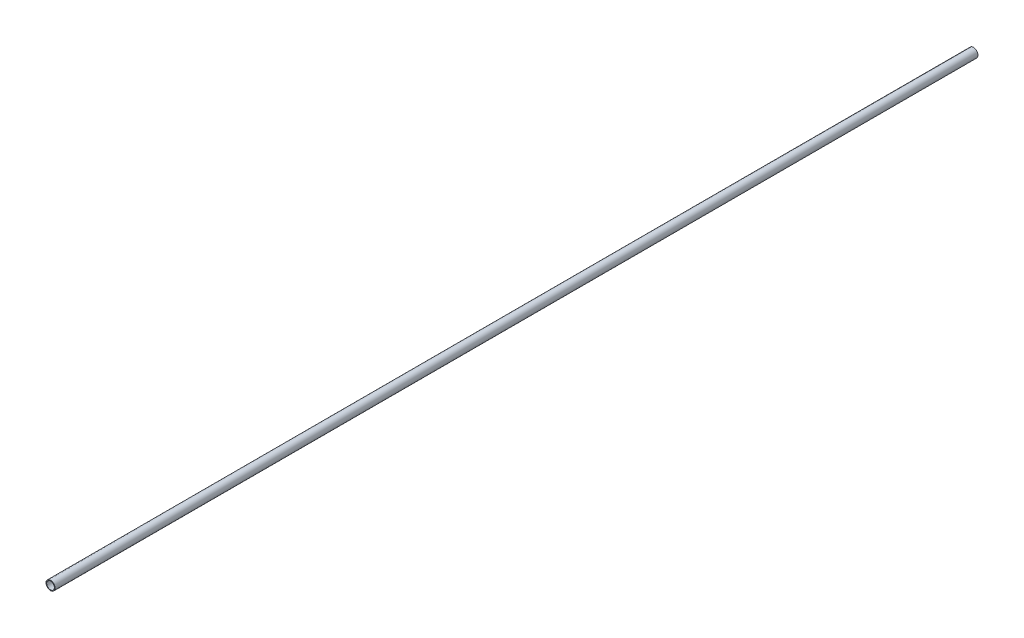
ISO-10303-21;
HEADER;
FILE_DESCRIPTION(('STEP AP214'),'2;1');
FILE_NAME('part.step','',(''),(''),'','','');
FILE_SCHEMA(('AUTOMOTIVE_DESIGN { 1 0 10303 214 1 1 1 1 }'));
ENDSEC;
DATA;
#1=APPLICATION_CONTEXT('core data for automotive mechanical design processes');
#2=APPLICATION_PROTOCOL_DEFINITION('international standard','automotive_design',2000,#1);
#3=PRODUCT_CONTEXT('',#1,'mechanical');
#4=PRODUCT('Part','Part','',(#3));
#5=PRODUCT_RELATED_PRODUCT_CATEGORY('part','',(#4));
#6=PRODUCT_DEFINITION_FORMATION('','',#4);
#7=PRODUCT_DEFINITION_CONTEXT('part definition',#1,'design');
#8=PRODUCT_DEFINITION('design','',#6,#7);
#9=PRODUCT_DEFINITION_SHAPE('','',#8);
#10=(LENGTH_UNIT() NAMED_UNIT(*) SI_UNIT(.MILLI.,.METRE.));
#11=(NAMED_UNIT(*) PLANE_ANGLE_UNIT() SI_UNIT($,.RADIAN.));
#12=(NAMED_UNIT(*) SI_UNIT($,.STERADIAN.) SOLID_ANGLE_UNIT());
#13=UNCERTAINTY_MEASURE_WITH_UNIT(LENGTH_MEASURE(1.E-05),#10,'distance_accuracy_value','');
#14=(GEOMETRIC_REPRESENTATION_CONTEXT(3) GLOBAL_UNCERTAINTY_ASSIGNED_CONTEXT((#13)) GLOBAL_UNIT_ASSIGNED_CONTEXT((#10,
#11,#12)) REPRESENTATION_CONTEXT('',''));
#15=CARTESIAN_POINT('',(0.,0.,0.));
#16=DIRECTION('',(0.,0.,1.));
#17=DIRECTION('',(1.,0.,0.));
#18=AXIS2_PLACEMENT_3D('',#15,#16,#17);
#19=CARTESIAN_POINT('',(0.,0.,1020.));
#20=DIRECTION('',(0.,0.,1.));
#21=DIRECTION('',(1.,0.,0.));
#22=AXIS2_PLACEMENT_3D('',#19,#20,#21);
#23=PLANE('',#22);
#24=CARTESIAN_POINT('',(0.,0.,1020.));
#25=DIRECTION('',(0.,0.,1.));
#26=DIRECTION('',(1.,0.,0.));
#27=AXIS2_PLACEMENT_3D('',#24,#25,#26);
#28=CIRCLE('',#27,5.);
#29=CARTESIAN_POINT('',(5.,0.,1020.));
#30=VERTEX_POINT('',#29);
#31=EDGE_CURVE('E10',#30,#30,#28,.T.);
#32=ORIENTED_EDGE('',*,*,#31,.T.);
#33=EDGE_LOOP('',(#32));
#34=FACE_BOUND('',#33,.T.);
#35=CARTESIAN_POINT('',(0.,0.,1020.));
#36=DIRECTION('',(0.,0.,1.));
#37=DIRECTION('',(1.,0.,0.));
#38=AXIS2_PLACEMENT_3D('',#35,#36,#37);
#39=CIRCLE('',#38,4.25);
#40=CARTESIAN_POINT('',(4.25,0.,1020.));
#41=VERTEX_POINT('',#40);
#42=EDGE_CURVE('E50',#41,#41,#39,.T.);
#43=ORIENTED_EDGE('',*,*,#42,.F.);
#44=EDGE_LOOP('',(#43));
#45=FACE_BOUND('',#44,.T.);
#46=ADVANCED_FACE('F37',(#34,#45),#23,.T.);
#47=CARTESIAN_POINT('',(0.,0.,0.));
#48=DIRECTION('',(0.,0.,1.));
#49=DIRECTION('',(1.,0.,0.));
#50=AXIS2_PLACEMENT_3D('',#47,#48,#49);
#51=PLANE('',#50);
#52=CARTESIAN_POINT('',(0.,0.,0.));
#53=DIRECTION('',(0.,0.,1.));
#54=DIRECTION('',(1.,0.,0.));
#55=AXIS2_PLACEMENT_3D('',#52,#53,#54);
#56=CIRCLE('',#55,5.);
#57=CARTESIAN_POINT('',(5.,0.,0.));
#58=VERTEX_POINT('',#57);
#59=EDGE_CURVE('E41',#58,#58,#56,.T.);
#60=ORIENTED_EDGE('',*,*,#59,.F.);
#61=EDGE_LOOP('',(#60));
#62=FACE_BOUND('',#61,.T.);
#63=CARTESIAN_POINT('',(0.,0.,0.));
#64=DIRECTION('',(0.,0.,1.));
#65=DIRECTION('',(1.,0.,0.));
#66=AXIS2_PLACEMENT_3D('',#63,#64,#65);
#67=CIRCLE('',#66,4.25);
#68=CARTESIAN_POINT('',(4.25,0.,0.));
#69=VERTEX_POINT('',#68);
#70=EDGE_CURVE('E52',#69,#69,#67,.T.);
#71=ORIENTED_EDGE('',*,*,#70,.T.);
#72=EDGE_LOOP('',(#71));
#73=FACE_BOUND('',#72,.T.);
#74=ADVANCED_FACE('F64',(#62,#73),#51,.F.);
#75=CARTESIAN_POINT('',(0.,0.,1020.));
#76=DIRECTION('',(0.,0.,-1.));
#77=DIRECTION('',(-1.,0.,0.));
#78=AXIS2_PLACEMENT_3D('',#75,#76,#77);
#79=CYLINDRICAL_SURFACE('',#78,5.);
#80=ORIENTED_EDGE('',*,*,#31,.F.);
#81=EDGE_LOOP('',(#80));
#82=FACE_BOUND('',#81,.T.);
#83=ORIENTED_EDGE('',*,*,#59,.T.);
#84=EDGE_LOOP('',(#83));
#85=FACE_BOUND('',#84,.T.);
#86=ADVANCED_FACE('F39',(#82,#85),#79,.T.);
#87=CARTESIAN_POINT('',(0.,0.,1020.));
#88=DIRECTION('',(0.,0.,-1.));
#89=DIRECTION('',(-1.,0.,0.));
#90=AXIS2_PLACEMENT_3D('',#87,#88,#89);
#91=CYLINDRICAL_SURFACE('',#90,4.25);
#92=ORIENTED_EDGE('',*,*,#42,.T.);
#93=EDGE_LOOP('',(#92));
#94=FACE_BOUND('',#93,.T.);
#95=ORIENTED_EDGE('',*,*,#70,.F.);
#96=EDGE_LOOP('',(#95));
#97=FACE_BOUND('',#96,.T.);
#98=ADVANCED_FACE('F60',(#94,#97),#91,.F.);
#99=CLOSED_SHELL('',(#46,#74,#86,#98));
#100=MANIFOLD_SOLID_BREP('B2',#99);
#101=ADVANCED_BREP_SHAPE_REPRESENTATION('',(#18,#100),#14);
#102=SHAPE_DEFINITION_REPRESENTATION(#9,#101);
ENDSEC;
END-ISO-10303-21;
